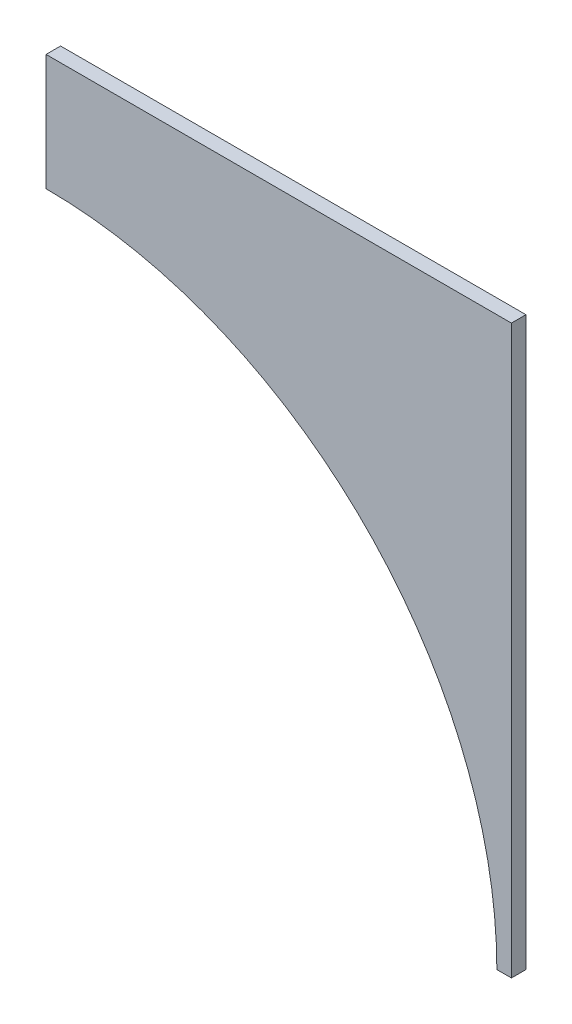
ISO-10303-21;
HEADER;
FILE_DESCRIPTION(('STEP AP214'),'2;1');
FILE_NAME('part.step','',(''),(''),'','','');
FILE_SCHEMA(('AUTOMOTIVE_DESIGN { 1 0 10303 214 1 1 1 1 }'));
ENDSEC;
DATA;
#1=APPLICATION_CONTEXT('core data for automotive mechanical design processes');
#2=APPLICATION_PROTOCOL_DEFINITION('international standard','automotive_design',2000,#1);
#3=PRODUCT_CONTEXT('',#1,'mechanical');
#4=PRODUCT('Part','Part','',(#3));
#5=PRODUCT_RELATED_PRODUCT_CATEGORY('part','',(#4));
#6=PRODUCT_DEFINITION_FORMATION('','',#4);
#7=PRODUCT_DEFINITION_CONTEXT('part definition',#1,'design');
#8=PRODUCT_DEFINITION('design','',#6,#7);
#9=PRODUCT_DEFINITION_SHAPE('','',#8);
#10=(LENGTH_UNIT() NAMED_UNIT(*) SI_UNIT(.MILLI.,.METRE.));
#11=(NAMED_UNIT(*) PLANE_ANGLE_UNIT() SI_UNIT($,.RADIAN.));
#12=(NAMED_UNIT(*) SI_UNIT($,.STERADIAN.) SOLID_ANGLE_UNIT());
#13=UNCERTAINTY_MEASURE_WITH_UNIT(LENGTH_MEASURE(1.E-05),#10,'distance_accuracy_value','');
#14=(GEOMETRIC_REPRESENTATION_CONTEXT(3) GLOBAL_UNCERTAINTY_ASSIGNED_CONTEXT((#13)) GLOBAL_UNIT_ASSIGNED_CONTEXT((#10,
#11,#12)) REPRESENTATION_CONTEXT('',''));
#15=CARTESIAN_POINT('',(0.,0.,0.));
#16=DIRECTION('',(0.,0.,1.));
#17=DIRECTION('',(1.,0.,0.));
#18=AXIS2_PLACEMENT_3D('',#15,#16,#17);
#19=CARTESIAN_POINT('',(-71.9538064610176,91.0399512472217,-3.175));
#20=DIRECTION('',(-1.,0.,0.));
#21=DIRECTION('',(0.,0.,1.));
#22=AXIS2_PLACEMENT_3D('',#19,#20,#21);
#23=PLANE('',#22);
#24=DIRECTION('',(0.,-1.,0.));
#25=VECTOR('',#24,1.);
#26=CARTESIAN_POINT('',(-71.9538064610176,91.0399512472217,0.));
#27=LINE('',#26,#25);
#28=CARTESIAN_POINT('',(-71.9538064610176,91.0399512472217,0.));
#29=VERTEX_POINT('',#28);
#30=CARTESIAN_POINT('',(-71.9538064610176,65.6399512472216,0.));
#31=VERTEX_POINT('',#30);
#32=EDGE_CURVE('E122',#29,#31,#27,.T.);
#33=ORIENTED_EDGE('',*,*,#32,.F.);
#34=DIRECTION('',(0.,0.,1.));
#35=VECTOR('',#34,1.);
#36=CARTESIAN_POINT('',(-71.9538064610176,91.0399512472217,-3.175));
#37=LINE('',#36,#35);
#38=CARTESIAN_POINT('',(-71.9538064610176,91.0399512472217,-3.175));
#39=VERTEX_POINT('',#38);
#40=EDGE_CURVE('E11',#39,#29,#37,.T.);
#41=ORIENTED_EDGE('',*,*,#40,.F.);
#42=DIRECTION('',(0.,-1.,0.));
#43=VECTOR('',#42,1.);
#44=CARTESIAN_POINT('',(-71.9538064610176,91.0399512472217,-3.175));
#45=LINE('',#44,#43);
#46=CARTESIAN_POINT('',(-71.9538064610176,65.6399512472216,-3.175));
#47=VERTEX_POINT('',#46);
#48=EDGE_CURVE('E116',#39,#47,#45,.T.);
#49=ORIENTED_EDGE('',*,*,#48,.T.);
#50=DIRECTION('',(0.,0.,1.));
#51=VECTOR('',#50,1.);
#52=CARTESIAN_POINT('',(-71.9538064610176,65.6399512472216,-3.175));
#53=LINE('',#52,#51);
#54=EDGE_CURVE('E42',#47,#31,#53,.T.);
#55=ORIENTED_EDGE('',*,*,#54,.T.);
#56=EDGE_LOOP('',(#33,#41,#49,#55));
#57=FACE_BOUND('',#56,.T.);
#58=ADVANCED_FACE('F39',(#57),#23,.T.);
#59=CARTESIAN_POINT('',(-71.9538064610176,91.0399512472217,-3.175));
#60=DIRECTION('',(0.,1.,0.));
#61=DIRECTION('',(0.,0.,1.));
#62=AXIS2_PLACEMENT_3D('',#59,#60,#61);
#63=PLANE('',#62);
#64=DIRECTION('',(-1.,0.,0.));
#65=VECTOR('',#64,1.);
#66=CARTESIAN_POINT('',(-71.9538064610176,91.0399512472217,0.));
#67=LINE('',#66,#65);
#68=CARTESIAN_POINT('',(29.6461935389824,91.0399512472217,0.));
#69=VERTEX_POINT('',#68);
#70=EDGE_CURVE('E135',#69,#29,#67,.T.);
#71=ORIENTED_EDGE('',*,*,#70,.F.);
#72=DIRECTION('',(0.,0.,1.));
#73=VECTOR('',#72,1.);
#74=CARTESIAN_POINT('',(29.6461935389824,91.0399512472217,-3.175));
#75=LINE('',#74,#73);
#76=CARTESIAN_POINT('',(29.6461935389824,91.0399512472217,-3.175));
#77=VERTEX_POINT('',#76);
#78=EDGE_CURVE('E49',#77,#69,#75,.T.);
#79=ORIENTED_EDGE('',*,*,#78,.F.);
#80=DIRECTION('',(-1.,0.,0.));
#81=VECTOR('',#80,1.);
#82=CARTESIAN_POINT('',(-71.9538064610176,91.0399512472217,-3.175));
#83=LINE('',#82,#81);
#84=EDGE_CURVE('E108',#77,#39,#83,.T.);
#85=ORIENTED_EDGE('',*,*,#84,.T.);
#86=ORIENTED_EDGE('',*,*,#40,.T.);
#87=EDGE_LOOP('',(#71,#79,#85,#86));
#88=FACE_BOUND('',#87,.T.);
#89=ADVANCED_FACE('F145',(#88),#63,.T.);
#90=CARTESIAN_POINT('',(29.6461935389824,91.0399512472217,-3.175));
#91=DIRECTION('',(1.,0.,0.));
#92=DIRECTION('',(0.,1.,0.));
#93=AXIS2_PLACEMENT_3D('',#90,#91,#92);
#94=PLANE('',#93);
#95=DIRECTION('',(0.,1.,0.));
#96=VECTOR('',#95,1.);
#97=CARTESIAN_POINT('',(29.6461935389824,91.0399512472217,0.));
#98=LINE('',#97,#96);
#99=CARTESIAN_POINT('',(29.6461935389824,-32.7850487527784,0.));
#100=VERTEX_POINT('',#99);
#101=EDGE_CURVE('E96',#100,#69,#98,.T.);
#102=ORIENTED_EDGE('',*,*,#101,.F.);
#103=DIRECTION('',(0.,0.,1.));
#104=VECTOR('',#103,1.);
#105=CARTESIAN_POINT('',(29.6461935389824,-32.7850487527784,-3.175));
#106=LINE('',#105,#104);
#107=CARTESIAN_POINT('',(29.6461935389824,-32.7850487527784,-3.175));
#108=VERTEX_POINT('',#107);
#109=EDGE_CURVE('E91',#108,#100,#106,.T.);
#110=ORIENTED_EDGE('',*,*,#109,.F.);
#111=DIRECTION('',(0.,1.,0.));
#112=VECTOR('',#111,1.);
#113=CARTESIAN_POINT('',(29.6461935389824,91.0399512472217,-3.175));
#114=LINE('',#113,#112);
#115=EDGE_CURVE('E94',#108,#77,#114,.T.);
#116=ORIENTED_EDGE('',*,*,#115,.T.);
#117=ORIENTED_EDGE('',*,*,#78,.T.);
#118=EDGE_LOOP('',(#102,#110,#116,#117));
#119=FACE_BOUND('',#118,.T.);
#120=ADVANCED_FACE('F93',(#119),#94,.T.);
#121=CARTESIAN_POINT('',(29.6461935389824,-32.7850487527784,-3.175));
#122=DIRECTION('',(0.,-1.,0.));
#123=DIRECTION('',(0.,0.,-1.));
#124=AXIS2_PLACEMENT_3D('',#121,#122,#123);
#125=PLANE('',#124);
#126=DIRECTION('',(1.,0.,0.));
#127=VECTOR('',#126,1.);
#128=CARTESIAN_POINT('',(29.6461935389824,-32.7850487527784,0.));
#129=LINE('',#128,#127);
#130=CARTESIAN_POINT('',(26.4711935389824,-32.7850487527784,0.));
#131=VERTEX_POINT('',#130);
#132=EDGE_CURVE('E130',#131,#100,#129,.T.);
#133=ORIENTED_EDGE('',*,*,#132,.F.);
#134=DIRECTION('',(0.,0.,1.));
#135=VECTOR('',#134,1.);
#136=CARTESIAN_POINT('',(26.4711935389824,-32.7850487527784,-3.175));
#137=LINE('',#136,#135);
#138=CARTESIAN_POINT('',(26.4711935389824,-32.7850487527784,-3.175));
#139=VERTEX_POINT('',#138);
#140=EDGE_CURVE('E102',#139,#131,#137,.T.);
#141=ORIENTED_EDGE('',*,*,#140,.F.);
#142=DIRECTION('',(1.,0.,0.));
#143=VECTOR('',#142,1.);
#144=CARTESIAN_POINT('',(29.6461935389824,-32.7850487527784,-3.175));
#145=LINE('',#144,#143);
#146=EDGE_CURVE('E107',#139,#108,#145,.T.);
#147=ORIENTED_EDGE('',*,*,#146,.T.);
#148=ORIENTED_EDGE('',*,*,#109,.T.);
#149=EDGE_LOOP('',(#133,#141,#147,#148));
#150=FACE_BOUND('',#149,.T.);
#151=ADVANCED_FACE('F111',(#150),#125,.T.);
#152=CARTESIAN_POINT('',(-71.9538064610176,-32.7850487527784,-3.175));
#153=DIRECTION('',(0.,0.,1.));
#154=DIRECTION('',(1.,0.,0.));
#155=AXIS2_PLACEMENT_3D('',#152,#153,#154);
#156=CYLINDRICAL_SURFACE('',#155,98.425);
#157=CARTESIAN_POINT('',(-71.9538064610176,-32.7850487527784,0.));
#158=DIRECTION('',(0.,0.,-1.));
#159=DIRECTION('',(1.,0.,0.));
#160=AXIS2_PLACEMENT_3D('',#157,#158,#159);
#161=CIRCLE('',#160,98.425);
#162=EDGE_CURVE('E126',#31,#131,#161,.T.);
#163=ORIENTED_EDGE('',*,*,#162,.F.);
#164=ORIENTED_EDGE('',*,*,#54,.F.);
#165=CARTESIAN_POINT('',(-71.9538064610176,-32.7850487527784,-3.175));
#166=DIRECTION('',(0.,0.,-1.));
#167=DIRECTION('',(1.,0.,0.));
#168=AXIS2_PLACEMENT_3D('',#165,#166,#167);
#169=CIRCLE('',#168,98.425);
#170=EDGE_CURVE('E113',#47,#139,#169,.T.);
#171=ORIENTED_EDGE('',*,*,#170,.T.);
#172=ORIENTED_EDGE('',*,*,#140,.T.);
#173=EDGE_LOOP('',(#163,#164,#171,#172));
#174=FACE_BOUND('',#173,.T.);
#175=ADVANCED_FACE('F142',(#174),#156,.F.);
#176=CARTESIAN_POINT('',(-71.9538064610176,-32.7850487527784,-3.175));
#177=DIRECTION('',(0.,0.,1.));
#178=DIRECTION('',(1.,0.,0.));
#179=AXIS2_PLACEMENT_3D('',#176,#177,#178);
#180=PLANE('',#179);
#181=ORIENTED_EDGE('',*,*,#48,.F.);
#182=ORIENTED_EDGE('',*,*,#84,.F.);
#183=ORIENTED_EDGE('',*,*,#115,.F.);
#184=ORIENTED_EDGE('',*,*,#146,.F.);
#185=ORIENTED_EDGE('',*,*,#170,.F.);
#186=EDGE_LOOP('',(#181,#182,#183,#184,#185));
#187=FACE_BOUND('',#186,.T.);
#188=ADVANCED_FACE('F106',(#187),#180,.F.);
#189=CARTESIAN_POINT('',(-71.9538064610176,-32.7850487527784,0.));
#190=DIRECTION('',(0.,0.,1.));
#191=DIRECTION('',(1.,0.,0.));
#192=AXIS2_PLACEMENT_3D('',#189,#190,#191);
#193=PLANE('',#192);
#194=ORIENTED_EDGE('',*,*,#32,.T.);
#195=ORIENTED_EDGE('',*,*,#162,.T.);
#196=ORIENTED_EDGE('',*,*,#132,.T.);
#197=ORIENTED_EDGE('',*,*,#101,.T.);
#198=ORIENTED_EDGE('',*,*,#70,.T.);
#199=EDGE_LOOP('',(#194,#195,#196,#197,#198));
#200=FACE_BOUND('',#199,.T.);
#201=ADVANCED_FACE('F144',(#200),#193,.T.);
#202=CLOSED_SHELL('',(#58,#89,#120,#151,#175,#188,#201));
#203=MANIFOLD_SOLID_BREP('B2',#202);
#204=ADVANCED_BREP_SHAPE_REPRESENTATION('',(#18,#203),#14);
#205=SHAPE_DEFINITION_REPRESENTATION(#9,#204);
ENDSEC;
END-ISO-10303-21;
